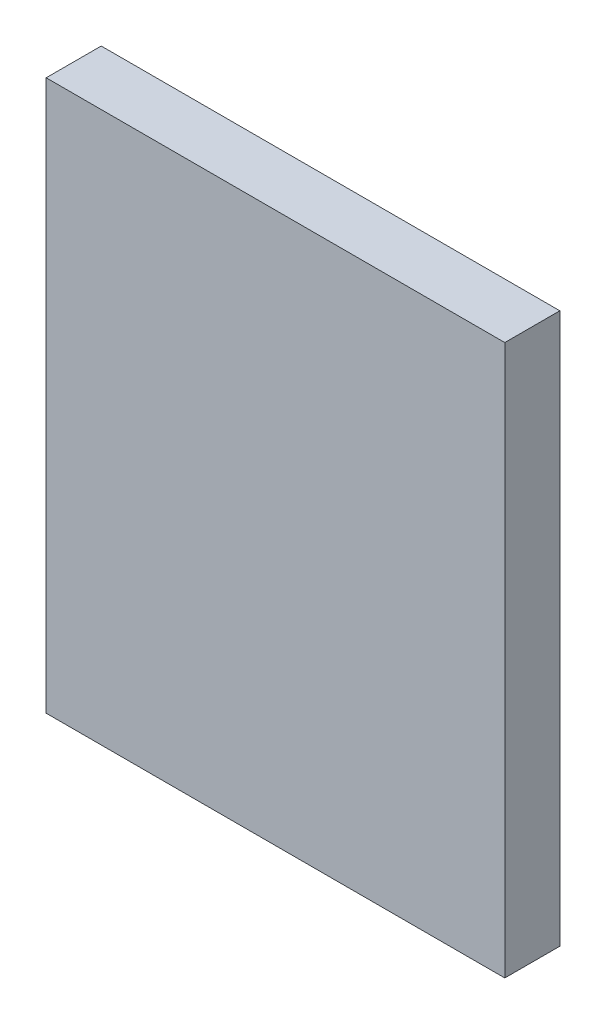
ISO-10303-21;
HEADER;
FILE_DESCRIPTION(('STEP AP214'),'2;1');
FILE_NAME('part.step','',(''),(''),'','','');
FILE_SCHEMA(('AUTOMOTIVE_DESIGN { 1 0 10303 214 1 1 1 1 }'));
ENDSEC;
DATA;
#1=APPLICATION_CONTEXT('core data for automotive mechanical design processes');
#2=APPLICATION_PROTOCOL_DEFINITION('international standard','automotive_design',2000,#1);
#3=PRODUCT_CONTEXT('',#1,'mechanical');
#4=PRODUCT('Part','Part','',(#3));
#5=PRODUCT_RELATED_PRODUCT_CATEGORY('part','',(#4));
#6=PRODUCT_DEFINITION_FORMATION('','',#4);
#7=PRODUCT_DEFINITION_CONTEXT('part definition',#1,'design');
#8=PRODUCT_DEFINITION('design','',#6,#7);
#9=PRODUCT_DEFINITION_SHAPE('','',#8);
#10=(LENGTH_UNIT() NAMED_UNIT(*) SI_UNIT(.MILLI.,.METRE.));
#11=(NAMED_UNIT(*) PLANE_ANGLE_UNIT() SI_UNIT($,.RADIAN.));
#12=(NAMED_UNIT(*) SI_UNIT($,.STERADIAN.) SOLID_ANGLE_UNIT());
#13=UNCERTAINTY_MEASURE_WITH_UNIT(LENGTH_MEASURE(1.E-05),#10,'distance_accuracy_value','');
#14=(GEOMETRIC_REPRESENTATION_CONTEXT(3) GLOBAL_UNCERTAINTY_ASSIGNED_CONTEXT((#13)) GLOBAL_UNIT_ASSIGNED_CONTEXT((#10,
#11,#12)) REPRESENTATION_CONTEXT('',''));
#15=CARTESIAN_POINT('',(0.,0.,0.));
#16=DIRECTION('',(0.,0.,1.));
#17=DIRECTION('',(1.,0.,0.));
#18=AXIS2_PLACEMENT_3D('',#15,#16,#17);
#19=CARTESIAN_POINT('',(-20.8816705336427,-51.0092807424594,6.));
#20=DIRECTION('',(0.,1.,0.));
#21=DIRECTION('',(0.,0.,1.));
#22=AXIS2_PLACEMENT_3D('',#19,#20,#21);
#23=PLANE('',#22);
#24=DIRECTION('',(1.,0.,0.));
#25=VECTOR('',#24,1.);
#26=CARTESIAN_POINT('',(-20.8816705336427,-51.0092807424594,0.));
#27=LINE('',#26,#25);
#28=CARTESIAN_POINT('',(-20.8816705336427,-51.0092807424594,0.));
#29=VERTEX_POINT('',#28);
#30=CARTESIAN_POINT('',(29.1183294663573,-51.0092807424594,0.));
#31=VERTEX_POINT('',#30);
#32=EDGE_CURVE('E112',#29,#31,#27,.T.);
#33=ORIENTED_EDGE('',*,*,#32,.T.);
#34=DIRECTION('',(0.,0.,-1.));
#35=VECTOR('',#34,1.);
#36=CARTESIAN_POINT('',(29.1183294663573,-51.0092807424594,6.));
#37=LINE('',#36,#35);
#38=CARTESIAN_POINT('',(29.1183294663573,-51.0092807424594,6.));
#39=VERTEX_POINT('',#38);
#40=EDGE_CURVE('E11',#39,#31,#37,.T.);
#41=ORIENTED_EDGE('',*,*,#40,.F.);
#42=DIRECTION('',(1.,0.,0.));
#43=VECTOR('',#42,1.);
#44=CARTESIAN_POINT('',(-20.8816705336427,-51.0092807424594,6.));
#45=LINE('',#44,#43);
#46=CARTESIAN_POINT('',(-20.8816705336427,-51.0092807424594,6.));
#47=VERTEX_POINT('',#46);
#48=EDGE_CURVE('E85',#47,#39,#45,.T.);
#49=ORIENTED_EDGE('',*,*,#48,.F.);
#50=DIRECTION('',(0.,0.,-1.));
#51=VECTOR('',#50,1.);
#52=CARTESIAN_POINT('',(-20.8816705336427,-51.0092807424594,6.));
#53=LINE('',#52,#51);
#54=EDGE_CURVE('E108',#47,#29,#53,.T.);
#55=ORIENTED_EDGE('',*,*,#54,.T.);
#56=EDGE_LOOP('',(#33,#41,#49,#55));
#57=FACE_BOUND('',#56,.T.);
#58=ADVANCED_FACE('F45',(#57),#23,.F.);
#59=CARTESIAN_POINT('',(29.1183294663573,8.9907192575406,6.));
#60=DIRECTION('',(1.,0.,0.));
#61=DIRECTION('',(0.,1.,0.));
#62=AXIS2_PLACEMENT_3D('',#59,#60,#61);
#63=PLANE('',#62);
#64=DIRECTION('',(0.,-1.,0.));
#65=VECTOR('',#64,1.);
#66=CARTESIAN_POINT('',(29.1183294663573,8.9907192575406,0.));
#67=LINE('',#66,#65);
#68=CARTESIAN_POINT('',(29.1183294663573,8.9907192575406,0.));
#69=VERTEX_POINT('',#68);
#70=EDGE_CURVE('E94',#69,#31,#67,.T.);
#71=ORIENTED_EDGE('',*,*,#70,.F.);
#72=DIRECTION('',(0.,0.,-1.));
#73=VECTOR('',#72,1.);
#74=CARTESIAN_POINT('',(29.1183294663573,8.9907192575406,6.));
#75=LINE('',#74,#73);
#76=CARTESIAN_POINT('',(29.1183294663573,8.9907192575406,6.));
#77=VERTEX_POINT('',#76);
#78=EDGE_CURVE('E54',#77,#69,#75,.T.);
#79=ORIENTED_EDGE('',*,*,#78,.F.);
#80=DIRECTION('',(0.,-1.,0.));
#81=VECTOR('',#80,1.);
#82=CARTESIAN_POINT('',(29.1183294663573,8.9907192575406,6.));
#83=LINE('',#82,#81);
#84=EDGE_CURVE('E92',#77,#39,#83,.T.);
#85=ORIENTED_EDGE('',*,*,#84,.T.);
#86=ORIENTED_EDGE('',*,*,#40,.T.);
#87=EDGE_LOOP('',(#71,#79,#85,#86));
#88=FACE_BOUND('',#87,.T.);
#89=ADVANCED_FACE('F91',(#88),#63,.T.);
#90=CARTESIAN_POINT('',(-20.8816705336427,8.9907192575406,6.));
#91=DIRECTION('',(0.,1.,0.));
#92=DIRECTION('',(0.,0.,1.));
#93=AXIS2_PLACEMENT_3D('',#90,#91,#92);
#94=PLANE('',#93);
#95=DIRECTION('',(1.,0.,0.));
#96=VECTOR('',#95,1.);
#97=CARTESIAN_POINT('',(-20.8816705336427,8.9907192575406,0.));
#98=LINE('',#97,#96);
#99=CARTESIAN_POINT('',(-20.8816705336427,8.9907192575406,0.));
#100=VERTEX_POINT('',#99);
#101=EDGE_CURVE('E118',#100,#69,#98,.T.);
#102=ORIENTED_EDGE('',*,*,#101,.F.);
#103=DIRECTION('',(0.,0.,-1.));
#104=VECTOR('',#103,1.);
#105=CARTESIAN_POINT('',(-20.8816705336427,8.9907192575406,6.));
#106=LINE('',#105,#104);
#107=CARTESIAN_POINT('',(-20.8816705336427,8.9907192575406,6.));
#108=VERTEX_POINT('',#107);
#109=EDGE_CURVE('E77',#108,#100,#106,.T.);
#110=ORIENTED_EDGE('',*,*,#109,.F.);
#111=DIRECTION('',(1.,0.,0.));
#112=VECTOR('',#111,1.);
#113=CARTESIAN_POINT('',(-20.8816705336427,8.9907192575406,6.));
#114=LINE('',#113,#112);
#115=EDGE_CURVE('E101',#108,#77,#114,.T.);
#116=ORIENTED_EDGE('',*,*,#115,.T.);
#117=ORIENTED_EDGE('',*,*,#78,.T.);
#118=EDGE_LOOP('',(#102,#110,#116,#117));
#119=FACE_BOUND('',#118,.T.);
#120=ADVANCED_FACE('F104',(#119),#94,.T.);
#121=CARTESIAN_POINT('',(-20.8816705336427,8.9907192575406,6.));
#122=DIRECTION('',(1.,0.,0.));
#123=DIRECTION('',(0.,1.,0.));
#124=AXIS2_PLACEMENT_3D('',#121,#122,#123);
#125=PLANE('',#124);
#126=DIRECTION('',(0.,-1.,0.));
#127=VECTOR('',#126,1.);
#128=CARTESIAN_POINT('',(-20.8816705336427,8.9907192575406,0.));
#129=LINE('',#128,#127);
#130=EDGE_CURVE('E80',#100,#29,#129,.T.);
#131=ORIENTED_EDGE('',*,*,#130,.T.);
#132=ORIENTED_EDGE('',*,*,#54,.F.);
#133=DIRECTION('',(0.,-1.,0.));
#134=VECTOR('',#133,1.);
#135=CARTESIAN_POINT('',(-20.8816705336427,8.9907192575406,6.));
#136=LINE('',#135,#134);
#137=EDGE_CURVE('E62',#108,#47,#136,.T.);
#138=ORIENTED_EDGE('',*,*,#137,.F.);
#139=ORIENTED_EDGE('',*,*,#109,.T.);
#140=EDGE_LOOP('',(#131,#132,#138,#139));
#141=FACE_BOUND('',#140,.T.);
#142=ADVANCED_FACE('F135',(#141),#125,.F.);
#143=CARTESIAN_POINT('',(0.,0.,6.));
#144=DIRECTION('',(0.,0.,-1.));
#145=DIRECTION('',(-1.,0.,0.));
#146=AXIS2_PLACEMENT_3D('',#143,#144,#145);
#147=PLANE('',#146);
#148=ORIENTED_EDGE('',*,*,#48,.T.);
#149=ORIENTED_EDGE('',*,*,#84,.F.);
#150=ORIENTED_EDGE('',*,*,#115,.F.);
#151=ORIENTED_EDGE('',*,*,#137,.T.);
#152=EDGE_LOOP('',(#148,#149,#150,#151));
#153=FACE_BOUND('',#152,.T.);
#154=ADVANCED_FACE('F100',(#153),#147,.F.);
#155=CARTESIAN_POINT('',(0.,0.,0.));
#156=DIRECTION('',(0.,0.,-1.));
#157=DIRECTION('',(-1.,0.,0.));
#158=AXIS2_PLACEMENT_3D('',#155,#156,#157);
#159=PLANE('',#158);
#160=ORIENTED_EDGE('',*,*,#32,.F.);
#161=ORIENTED_EDGE('',*,*,#130,.F.);
#162=ORIENTED_EDGE('',*,*,#101,.T.);
#163=ORIENTED_EDGE('',*,*,#70,.T.);
#164=EDGE_LOOP('',(#160,#161,#162,#163));
#165=FACE_BOUND('',#164,.T.);
#166=ADVANCED_FACE('F129',(#165),#159,.T.);
#167=CLOSED_SHELL('',(#58,#89,#120,#142,#154,#166));
#168=MANIFOLD_SOLID_BREP('B2',#167);
#169=ADVANCED_BREP_SHAPE_REPRESENTATION('',(#18,#168),#14);
#170=SHAPE_DEFINITION_REPRESENTATION(#9,#169);
ENDSEC;
END-ISO-10303-21;
